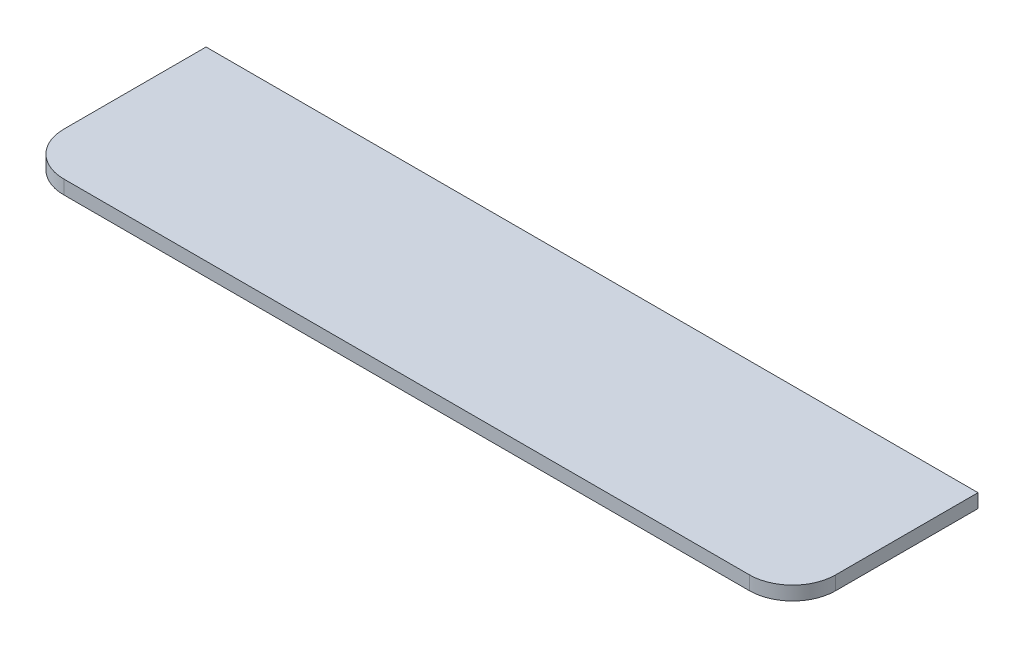
ISO-10303-21;
HEADER;
FILE_DESCRIPTION(('STEP AP214'),'2;1');
FILE_NAME('part.step','',(''),(''),'','','');
FILE_SCHEMA(('AUTOMOTIVE_DESIGN { 1 0 10303 214 1 1 1 1 }'));
ENDSEC;
DATA;
#1=APPLICATION_CONTEXT('core data for automotive mechanical design processes');
#2=APPLICATION_PROTOCOL_DEFINITION('international standard','automotive_design',2000,#1);
#3=PRODUCT_CONTEXT('',#1,'mechanical');
#4=PRODUCT('Part','Part','',(#3));
#5=PRODUCT_RELATED_PRODUCT_CATEGORY('part','',(#4));
#6=PRODUCT_DEFINITION_FORMATION('','',#4);
#7=PRODUCT_DEFINITION_CONTEXT('part definition',#1,'design');
#8=PRODUCT_DEFINITION('design','',#6,#7);
#9=PRODUCT_DEFINITION_SHAPE('','',#8);
#10=(LENGTH_UNIT() NAMED_UNIT(*) SI_UNIT(.MILLI.,.METRE.));
#11=(NAMED_UNIT(*) PLANE_ANGLE_UNIT() SI_UNIT($,.RADIAN.));
#12=(NAMED_UNIT(*) SI_UNIT($,.STERADIAN.) SOLID_ANGLE_UNIT());
#13=UNCERTAINTY_MEASURE_WITH_UNIT(LENGTH_MEASURE(1.E-05),#10,'distance_accuracy_value','');
#14=(GEOMETRIC_REPRESENTATION_CONTEXT(3) GLOBAL_UNCERTAINTY_ASSIGNED_CONTEXT((#13)) GLOBAL_UNIT_ASSIGNED_CONTEXT((#10,
#11,#12)) REPRESENTATION_CONTEXT('',''));
#15=CARTESIAN_POINT('',(0.,0.,0.));
#16=DIRECTION('',(0.,0.,1.));
#17=DIRECTION('',(1.,0.,0.));
#18=AXIS2_PLACEMENT_3D('',#15,#16,#17);
#19=CARTESIAN_POINT('',(0.,16.,0.));
#20=DIRECTION('',(1.,0.,0.));
#21=DIRECTION('',(0.,0.,-1.));
#22=AXIS2_PLACEMENT_3D('',#19,#20,#21);
#23=PLANE('',#22);
#24=DIRECTION('',(0.,0.,1.));
#25=VECTOR('',#24,1.);
#26=CARTESIAN_POINT('',(0.,0.,0.));
#27=LINE('',#26,#25);
#28=CARTESIAN_POINT('',(0.,0.,0.));
#29=VERTEX_POINT('',#28);
#30=CARTESIAN_POINT('',(0.,0.,165.));
#31=VERTEX_POINT('',#30);
#32=EDGE_CURVE('E119',#29,#31,#27,.T.);
#33=ORIENTED_EDGE('',*,*,#32,.T.);
#34=DIRECTION('',(0.,-1.,0.));
#35=VECTOR('',#34,1.);
#36=CARTESIAN_POINT('',(0.,16.,165.));
#37=LINE('',#36,#35);
#38=CARTESIAN_POINT('',(0.,16.,165.));
#39=VERTEX_POINT('',#38);
#40=EDGE_CURVE('E11',#39,#31,#37,.T.);
#41=ORIENTED_EDGE('',*,*,#40,.F.);
#42=DIRECTION('',(0.,0.,1.));
#43=VECTOR('',#42,1.);
#44=CARTESIAN_POINT('',(0.,16.,0.));
#45=LINE('',#44,#43);
#46=CARTESIAN_POINT('',(0.,16.,0.));
#47=VERTEX_POINT('',#46);
#48=EDGE_CURVE('E129',#47,#39,#45,.T.);
#49=ORIENTED_EDGE('',*,*,#48,.F.);
#50=DIRECTION('',(0.,-1.,0.));
#51=VECTOR('',#50,1.);
#52=CARTESIAN_POINT('',(0.,16.,0.));
#53=LINE('',#52,#51);
#54=EDGE_CURVE('E115',#47,#29,#53,.T.);
#55=ORIENTED_EDGE('',*,*,#54,.T.);
#56=EDGE_LOOP('',(#33,#41,#49,#55));
#57=FACE_BOUND('',#56,.T.);
#58=ADVANCED_FACE('F35',(#57),#23,.F.);
#59=CARTESIAN_POINT('',(50.,16.,165.));
#60=DIRECTION('',(0.,-1.,0.));
#61=DIRECTION('',(0.,0.,-1.));
#62=AXIS2_PLACEMENT_3D('',#59,#60,#61);
#63=CYLINDRICAL_SURFACE('',#62,50.);
#64=CARTESIAN_POINT('',(50.,0.,165.));
#65=DIRECTION('',(0.,1.,0.));
#66=DIRECTION('',(0.,0.,1.));
#67=AXIS2_PLACEMENT_3D('',#64,#65,#66);
#68=CIRCLE('',#67,50.);
#69=CARTESIAN_POINT('',(50.0000000000004,0.,215.));
#70=VERTEX_POINT('',#69);
#71=EDGE_CURVE('E122',#31,#70,#68,.T.);
#72=ORIENTED_EDGE('',*,*,#71,.T.);
#73=DIRECTION('',(0.,-1.,0.));
#74=VECTOR('',#73,1.);
#75=CARTESIAN_POINT('',(50.0000000000004,16.,215.));
#76=LINE('',#75,#74);
#77=CARTESIAN_POINT('',(50.0000000000004,16.,215.));
#78=VERTEX_POINT('',#77);
#79=EDGE_CURVE('E43',#78,#70,#76,.T.);
#80=ORIENTED_EDGE('',*,*,#79,.F.);
#81=CARTESIAN_POINT('',(50.,16.,165.));
#82=DIRECTION('',(0.,1.,0.));
#83=DIRECTION('',(0.,0.,1.));
#84=AXIS2_PLACEMENT_3D('',#81,#82,#83);
#85=CIRCLE('',#84,50.);
#86=EDGE_CURVE('E88',#39,#78,#85,.T.);
#87=ORIENTED_EDGE('',*,*,#86,.F.);
#88=ORIENTED_EDGE('',*,*,#40,.T.);
#89=EDGE_LOOP('',(#72,#80,#87,#88));
#90=FACE_BOUND('',#89,.T.);
#91=ADVANCED_FACE('F153',(#90),#63,.T.);
#92=CARTESIAN_POINT('',(50.0000000000004,16.,215.));
#93=DIRECTION('',(0.,0.,-1.));
#94=DIRECTION('',(-1.,0.,0.));
#95=AXIS2_PLACEMENT_3D('',#92,#93,#94);
#96=PLANE('',#95);
#97=DIRECTION('',(1.,0.,0.));
#98=VECTOR('',#97,1.);
#99=CARTESIAN_POINT('',(50.0000000000004,0.,215.));
#100=LINE('',#99,#98);
#101=CARTESIAN_POINT('',(845.,0.,215.));
#102=VERTEX_POINT('',#101);
#103=EDGE_CURVE('E124',#70,#102,#100,.T.);
#104=ORIENTED_EDGE('',*,*,#103,.T.);
#105=DIRECTION('',(0.,-1.,0.));
#106=VECTOR('',#105,1.);
#107=CARTESIAN_POINT('',(845.,16.,215.));
#108=LINE('',#107,#106);
#109=CARTESIAN_POINT('',(845.,16.,215.));
#110=VERTEX_POINT('',#109);
#111=EDGE_CURVE('E110',#110,#102,#108,.T.);
#112=ORIENTED_EDGE('',*,*,#111,.F.);
#113=DIRECTION('',(1.,0.,0.));
#114=VECTOR('',#113,1.);
#115=CARTESIAN_POINT('',(50.0000000000004,16.,215.));
#116=LINE('',#115,#114);
#117=EDGE_CURVE('E101',#78,#110,#116,.T.);
#118=ORIENTED_EDGE('',*,*,#117,.F.);
#119=ORIENTED_EDGE('',*,*,#79,.T.);
#120=EDGE_LOOP('',(#104,#112,#118,#119));
#121=FACE_BOUND('',#120,.T.);
#122=ADVANCED_FACE('F135',(#121),#96,.F.);
#123=CARTESIAN_POINT('',(845.,16.,165.));
#124=DIRECTION('',(0.,-1.,0.));
#125=DIRECTION('',(0.,0.,-1.));
#126=AXIS2_PLACEMENT_3D('',#123,#124,#125);
#127=CYLINDRICAL_SURFACE('',#126,50.);
#128=CARTESIAN_POINT('',(845.,0.,165.));
#129=DIRECTION('',(0.,1.,0.));
#130=DIRECTION('',(0.,0.,1.));
#131=AXIS2_PLACEMENT_3D('',#128,#129,#130);
#132=CIRCLE('',#131,50.);
#133=CARTESIAN_POINT('',(895.,0.,165.));
#134=VERTEX_POINT('',#133);
#135=EDGE_CURVE('E109',#102,#134,#132,.T.);
#136=ORIENTED_EDGE('',*,*,#135,.T.);
#137=DIRECTION('',(0.,-1.,0.));
#138=VECTOR('',#137,1.);
#139=CARTESIAN_POINT('',(895.,16.,165.));
#140=LINE('',#139,#138);
#141=CARTESIAN_POINT('',(895.,16.,165.));
#142=VERTEX_POINT('',#141);
#143=EDGE_CURVE('E106',#142,#134,#140,.T.);
#144=ORIENTED_EDGE('',*,*,#143,.F.);
#145=CARTESIAN_POINT('',(845.,16.,165.));
#146=DIRECTION('',(0.,1.,0.));
#147=DIRECTION('',(0.,0.,1.));
#148=AXIS2_PLACEMENT_3D('',#145,#146,#147);
#149=CIRCLE('',#148,50.);
#150=EDGE_CURVE('E95',#110,#142,#149,.T.);
#151=ORIENTED_EDGE('',*,*,#150,.F.);
#152=ORIENTED_EDGE('',*,*,#111,.T.);
#153=EDGE_LOOP('',(#136,#144,#151,#152));
#154=FACE_BOUND('',#153,.T.);
#155=ADVANCED_FACE('F107',(#154),#127,.T.);
#156=CARTESIAN_POINT('',(895.,16.,0.));
#157=DIRECTION('',(-1.,0.,0.));
#158=DIRECTION('',(0.,0.,1.));
#159=AXIS2_PLACEMENT_3D('',#156,#157,#158);
#160=PLANE('',#159);
#161=DIRECTION('',(0.,0.,-1.));
#162=VECTOR('',#161,1.);
#163=CARTESIAN_POINT('',(895.,0.,0.));
#164=LINE('',#163,#162);
#165=CARTESIAN_POINT('',(895.,0.,0.));
#166=VERTEX_POINT('',#165);
#167=EDGE_CURVE('E74',#134,#166,#164,.T.);
#168=ORIENTED_EDGE('',*,*,#167,.T.);
#169=DIRECTION('',(0.,-1.,0.));
#170=VECTOR('',#169,1.);
#171=CARTESIAN_POINT('',(895.,16.,0.));
#172=LINE('',#171,#170);
#173=CARTESIAN_POINT('',(895.,16.,0.));
#174=VERTEX_POINT('',#173);
#175=EDGE_CURVE('E111',#174,#166,#172,.T.);
#176=ORIENTED_EDGE('',*,*,#175,.F.);
#177=DIRECTION('',(0.,0.,-1.));
#178=VECTOR('',#177,1.);
#179=CARTESIAN_POINT('',(895.,16.,0.));
#180=LINE('',#179,#178);
#181=EDGE_CURVE('E99',#142,#174,#180,.T.);
#182=ORIENTED_EDGE('',*,*,#181,.F.);
#183=ORIENTED_EDGE('',*,*,#143,.T.);
#184=EDGE_LOOP('',(#168,#176,#182,#183));
#185=FACE_BOUND('',#184,.T.);
#186=ADVANCED_FACE('F113',(#185),#160,.F.);
#187=CARTESIAN_POINT('',(0.,16.,0.));
#188=DIRECTION('',(0.,0.,1.));
#189=DIRECTION('',(1.,0.,0.));
#190=AXIS2_PLACEMENT_3D('',#187,#188,#189);
#191=PLANE('',#190);
#192=DIRECTION('',(-1.,0.,0.));
#193=VECTOR('',#192,1.);
#194=CARTESIAN_POINT('',(0.,0.,0.));
#195=LINE('',#194,#193);
#196=EDGE_CURVE('E80',#166,#29,#195,.T.);
#197=ORIENTED_EDGE('',*,*,#196,.T.);
#198=ORIENTED_EDGE('',*,*,#54,.F.);
#199=DIRECTION('',(-1.,0.,0.));
#200=VECTOR('',#199,1.);
#201=CARTESIAN_POINT('',(0.,16.,0.));
#202=LINE('',#201,#200);
#203=EDGE_CURVE('E51',#174,#47,#202,.T.);
#204=ORIENTED_EDGE('',*,*,#203,.F.);
#205=ORIENTED_EDGE('',*,*,#175,.T.);
#206=EDGE_LOOP('',(#197,#198,#204,#205));
#207=FACE_BOUND('',#206,.T.);
#208=ADVANCED_FACE('F142',(#207),#191,.F.);
#209=CARTESIAN_POINT('',(50.,16.,165.));
#210=DIRECTION('',(0.,1.,0.));
#211=DIRECTION('',(0.,0.,1.));
#212=AXIS2_PLACEMENT_3D('',#209,#210,#211);
#213=PLANE('',#212);
#214=ORIENTED_EDGE('',*,*,#48,.T.);
#215=ORIENTED_EDGE('',*,*,#86,.T.);
#216=ORIENTED_EDGE('',*,*,#117,.T.);
#217=ORIENTED_EDGE('',*,*,#150,.T.);
#218=ORIENTED_EDGE('',*,*,#181,.T.);
#219=ORIENTED_EDGE('',*,*,#203,.T.);
#220=EDGE_LOOP('',(#214,#215,#216,#217,#218,#219));
#221=FACE_BOUND('',#220,.T.);
#222=ADVANCED_FACE('F97',(#221),#213,.T.);
#223=CARTESIAN_POINT('',(50.,0.,165.));
#224=DIRECTION('',(0.,1.,0.));
#225=DIRECTION('',(0.,0.,1.));
#226=AXIS2_PLACEMENT_3D('',#223,#224,#225);
#227=PLANE('',#226);
#228=ORIENTED_EDGE('',*,*,#32,.F.);
#229=ORIENTED_EDGE('',*,*,#196,.F.);
#230=ORIENTED_EDGE('',*,*,#167,.F.);
#231=ORIENTED_EDGE('',*,*,#135,.F.);
#232=ORIENTED_EDGE('',*,*,#103,.F.);
#233=ORIENTED_EDGE('',*,*,#71,.F.);
#234=EDGE_LOOP('',(#228,#229,#230,#231,#232,#233));
#235=FACE_BOUND('',#234,.T.);
#236=ADVANCED_FACE('F138',(#235),#227,.F.);
#237=CLOSED_SHELL('',(#58,#91,#122,#155,#186,#208,#222,#236));
#238=MANIFOLD_SOLID_BREP('B2',#237);
#239=ADVANCED_BREP_SHAPE_REPRESENTATION('',(#18,#238),#14);
#240=SHAPE_DEFINITION_REPRESENTATION(#9,#239);
ENDSEC;
END-ISO-10303-21;
